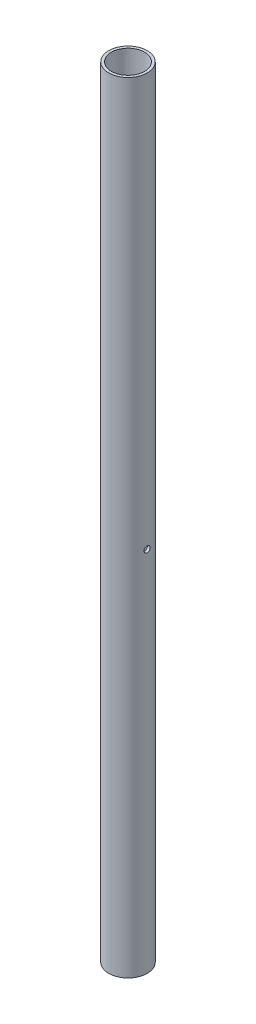
ISO-10303-21;
HEADER;
FILE_DESCRIPTION(('STEP AP214'),'2;1');
FILE_NAME('part.step','',(''),(''),'','','');
FILE_SCHEMA(('AUTOMOTIVE_DESIGN { 1 0 10303 214 1 1 1 1 }'));
ENDSEC;
DATA;
#1=APPLICATION_CONTEXT('core data for automotive mechanical design processes');
#2=APPLICATION_PROTOCOL_DEFINITION('international standard','automotive_design',2000,#1);
#3=PRODUCT_CONTEXT('',#1,'mechanical');
#4=PRODUCT('Part','Part','',(#3));
#5=PRODUCT_RELATED_PRODUCT_CATEGORY('part','',(#4));
#6=PRODUCT_DEFINITION_FORMATION('','',#4);
#7=PRODUCT_DEFINITION_CONTEXT('part definition',#1,'design');
#8=PRODUCT_DEFINITION('design','',#6,#7);
#9=PRODUCT_DEFINITION_SHAPE('','',#8);
#10=(LENGTH_UNIT() NAMED_UNIT(*) SI_UNIT(.MILLI.,.METRE.));
#11=(NAMED_UNIT(*) PLANE_ANGLE_UNIT() SI_UNIT($,.RADIAN.));
#12=(NAMED_UNIT(*) SI_UNIT($,.STERADIAN.) SOLID_ANGLE_UNIT());
#13=UNCERTAINTY_MEASURE_WITH_UNIT(LENGTH_MEASURE(1.E-05),#10,'distance_accuracy_value','');
#14=(GEOMETRIC_REPRESENTATION_CONTEXT(3) GLOBAL_UNCERTAINTY_ASSIGNED_CONTEXT((#13)) GLOBAL_UNIT_ASSIGNED_CONTEXT((#10,
#11,#12)) REPRESENTATION_CONTEXT('',''));
#15=CARTESIAN_POINT('',(0.,0.,0.));
#16=DIRECTION('',(0.,0.,1.));
#17=DIRECTION('',(1.,0.,0.));
#18=AXIS2_PLACEMENT_3D('',#15,#16,#17);
#19=CARTESIAN_POINT('',(0.,0.,0.));
#20=DIRECTION('',(0.,1.,0.));
#21=DIRECTION('',(0.,0.,1.));
#22=AXIS2_PLACEMENT_3D('',#19,#20,#21);
#23=CYLINDRICAL_SURFACE('',#22,25.9969);
#24=CARTESIAN_POINT('',(-25.5569443275208,574.167,-4.7625));
#25=CARTESIAN_POINT('',(-25.5569435022314,574.034426906002,-4.7625016519942));
#26=CARTESIAN_POINT('',(-25.5579780058452,573.901877137919,-4.75696223854384));
#27=CARTESIAN_POINT('',(-25.5620839582937,573.637691134125,-4.73485019257146));
#28=CARTESIAN_POINT('',(-25.5651558625793,573.506055109327,-4.71827509307285));
#29=CARTESIAN_POINT('',(-25.5732507134713,573.244589682944,-4.6742012203701));
#30=CARTESIAN_POINT('',(-25.5782750896231,573.114761677452,-4.64669444296097));
#31=CARTESIAN_POINT('',(-25.5901293091623,572.857883779135,-4.58096125738));
#32=CARTESIAN_POINT('',(-25.5969598199364,572.730834932066,-4.54273088640442));
#33=CARTESIAN_POINT('',(-25.6122182453585,572.480617273474,-4.45589791590844));
#34=CARTESIAN_POINT('',(-25.6206439910637,572.357443455452,-4.40730938856463));
#35=CARTESIAN_POINT('',(-25.6388562536836,572.115630240645,-4.30009396111335));
#36=CARTESIAN_POINT('',(-25.6486432791552,571.99699255972,-4.24146330749237));
#37=CARTESIAN_POINT('',(-25.6796278990718,571.649265264878,-4.05118392120631));
#38=CARTESIAN_POINT('',(-25.7024688505728,571.428053388312,-3.90504041367218));
#39=CARTESIAN_POINT('',(-25.7502464376007,571.010838011115,-3.57649200963156));
#40=CARTESIAN_POINT('',(-25.7752026783148,570.815125783708,-3.39372004066405));
#41=CARTESIAN_POINT('',(-25.8119525931666,570.546587700914,-3.09707856477701));
#42=CARTESIAN_POINT('',(-25.8240964249994,570.461197739246,-2.99437418317596));
#43=CARTESIAN_POINT('',(-25.8478225338879,570.299322515098,-2.78213250866639));
#44=CARTESIAN_POINT('',(-25.8594050197638,570.222833926246,-2.6725977918532));
#45=CARTESIAN_POINT('',(-25.8817765032373,570.078716113158,-2.44652067815375));
#46=CARTESIAN_POINT('',(-25.8925583288723,570.011163511535,-2.32992878685024));
#47=CARTESIAN_POINT('',(-25.912915133473,569.886162545654,-2.09140107944697));
#48=CARTESIAN_POINT('',(-25.9224905605596,569.828710426382,-1.96946727043824));
#49=CARTESIAN_POINT('',(-25.9401588219765,569.724356398202,-1.72117462286801));
#50=CARTESIAN_POINT('',(-25.9482528513248,569.677445978463,-1.59481944984244));
#51=CARTESIAN_POINT('',(-25.9627347127051,569.594489332138,-1.33854185813782));
#52=CARTESIAN_POINT('',(-25.9691229604252,569.558440458387,-1.20862031708668));
#53=CARTESIAN_POINT('',(-25.9818790112736,569.487012086128,-0.901033281887136));
#54=CARTESIAN_POINT('',(-25.9874880450333,569.456104369801,-0.722278498790977));
#55=CARTESIAN_POINT('',(-25.9949979755023,569.414849638883,-0.362334596423418));
#56=CARTESIAN_POINT('',(-25.9968989372398,569.404502263726,-0.181145519898159));
#57=CARTESIAN_POINT('',(-25.9969007779147,569.404498343007,0.132594129715133));
#58=CARTESIAN_POINT('',(-25.9958836117793,569.410039477896,0.265164922289751));
#59=CARTESIAN_POINT('',(-25.9918448928766,569.432158710194,0.52939367289199));
#60=CARTESIAN_POINT('',(-25.9888228924146,569.448739272793,0.661051420392835));
#61=CARTESIAN_POINT('',(-25.9808549279305,569.492827640559,0.92256018806719));
#62=CARTESIAN_POINT('',(-25.9759075612562,569.520343412467,1.05240981940978));
#63=CARTESIAN_POINT('',(-25.9642253634347,569.586100313305,1.30933322500081));
#64=CARTESIAN_POINT('',(-25.9574898727271,569.624345400104,1.43640595621574));
#65=CARTESIAN_POINT('',(-25.9424297829589,569.711207687545,1.68666596023607));
#66=CARTESIAN_POINT('',(-25.9341073184392,569.759810966234,1.80985819603276));
#67=CARTESIAN_POINT('',(-25.916093926232,569.867079543716,2.05173076847075));
#68=CARTESIAN_POINT('',(-25.9064024942186,569.925748552429,2.17040942177106));
#69=CARTESIAN_POINT('',(-25.8859250278616,570.052679850368,2.4023412043127));
#70=CARTESIAN_POINT('',(-25.8751395539806,570.120937234432,2.51559706823607));
#71=CARTESIAN_POINT('',(-25.8527606026393,570.266614428611,2.73602971122386));
#72=CARTESIAN_POINT('',(-25.8411668248522,570.344037651852,2.84320420362534));
#73=CARTESIAN_POINT('',(-25.8173738130133,570.508304243676,3.05174437268176));
#74=CARTESIAN_POINT('',(-25.8051697173725,570.595233364841,3.15304195602531));
#75=CARTESIAN_POINT('',(-25.780598999428,570.777306970566,3.34801213856994));
#76=CARTESIAN_POINT('',(-25.7682323185993,570.872454486148,3.44168189960051));
#77=CARTESIAN_POINT('',(-25.7436899636838,571.070260531103,3.62069031311283));
#78=CARTESIAN_POINT('',(-25.7315142352722,571.17291687539,3.70603137252294));
#79=CARTESIAN_POINT('',(-25.7076877679954,571.385107943582,3.86785374086368));
#80=CARTESIAN_POINT('',(-25.6960372244145,571.494645190422,3.9443317705104));
#81=CARTESIAN_POINT('',(-25.6735156111352,571.720629805377,4.08836891049098));
#82=CARTESIAN_POINT('',(-25.6626507376893,571.83712113571,4.15586005076397));
#83=CARTESIAN_POINT('',(-25.6421052945682,572.075524084205,4.28080083570022));
#84=CARTESIAN_POINT('',(-25.6324251688821,572.197437711201,4.33824671929931));
#85=CARTESIAN_POINT('',(-25.6145431566518,572.44574272747,4.44261177958259));
#86=CARTESIAN_POINT('',(-25.606340622071,572.572132124529,4.48953557322954));
#87=CARTESIAN_POINT('',(-25.5916480394946,572.82853707486,4.57253899249754));
#88=CARTESIAN_POINT('',(-25.5851586235047,572.958553946879,4.60861461668063));
#89=CARTESIAN_POINT('',(-25.5687024999131,573.349615748578,4.69938414902781));
#90=CARTESIAN_POINT('',(-25.5615208483999,573.614730099288,4.73790033784556));
#91=CARTESIAN_POINT('',(-25.5555629285528,574.14774525015,4.76993772216578));
#92=CARTESIAN_POINT('',(-25.5567859538712,574.415645814252,4.76346269882962));
#93=CARTESIAN_POINT('',(-25.5647387239316,574.811826221684,4.72049188836733));
#94=CARTESIAN_POINT('',(-25.568370638211,574.942195247262,4.70083518426897));
#95=CARTESIAN_POINT('',(-25.5775186860862,575.200777215956,4.65080871656991));
#96=CARTESIAN_POINT('',(-25.5830341147503,575.328990946913,4.62044296084381));
#97=CARTESIAN_POINT('',(-25.5957962924784,575.582424100489,4.54921115931196));
#98=CARTESIAN_POINT('',(-25.6030437284578,575.707642313352,4.50834094694428));
#99=CARTESIAN_POINT('',(-25.6190583120678,575.954138330245,4.41642801319908));
#100=CARTESIAN_POINT('',(-25.6278249270543,576.075417497718,4.36538885624997));
#101=CARTESIAN_POINT('',(-25.6466903301581,576.313986550088,4.25315647739893));
#102=CARTESIAN_POINT('',(-25.6567969483597,576.431247453408,4.19190298121288));
#103=CARTESIAN_POINT('',(-25.6780114393711,576.660161375324,4.05992628497872));
#104=CARTESIAN_POINT('',(-25.6891189589237,576.771816350974,3.9892064217367));
#105=CARTESIAN_POINT('',(-25.7120327805372,576.988857273146,3.83874595290599));
#106=CARTESIAN_POINT('',(-25.7238393357904,577.094240920125,3.75900206914764));
#107=CARTESIAN_POINT('',(-25.7478169181814,577.297958819531,3.59108914908507));
#108=CARTESIAN_POINT('',(-25.7599878155341,577.396295540814,3.50292308895362));
#109=CARTESIAN_POINT('',(-25.7845502224845,577.586748767761,3.3173290184684));
#110=CARTESIAN_POINT('',(-25.7969422681437,577.678747681698,3.21978036448215));
#111=CARTESIAN_POINT('',(-25.8214090593172,577.854181427793,3.01728983543673));
#112=CARTESIAN_POINT('',(-25.8334839178131,577.937619341008,2.91235064328351));
#113=CARTESIAN_POINT('',(-25.8569918465873,578.095450168811,2.69567518535068));
#114=CARTESIAN_POINT('',(-25.8684243803524,578.169835580866,2.58393339522678));
#115=CARTESIAN_POINT('',(-25.8903109800241,578.308921792068,2.35454332728406));
#116=CARTESIAN_POINT('',(-25.9007654165309,578.373626264928,2.23689731274309));
#117=CARTESIAN_POINT('',(-25.9204288529103,578.493049874451,1.99619411066832));
#118=CARTESIAN_POINT('',(-25.9296348712611,578.547745212,1.87312486779611));
#119=CARTESIAN_POINT('',(-25.9465068680863,578.646529519597,1.62275223016558));
#120=CARTESIAN_POINT('',(-25.9541734443674,578.6906226081,1.49545050146611));
#121=CARTESIAN_POINT('',(-25.9677402551085,578.767823056664,1.23770085854887));
#122=CARTESIAN_POINT('',(-25.9736434204478,578.800948655299,1.10725855855992));
#123=CARTESIAN_POINT('',(-25.9835288197735,578.856040873629,0.84402082991778));
#124=CARTESIAN_POINT('',(-25.9875119724719,578.878012830528,0.711226558264559));
#125=CARTESIAN_POINT('',(-25.9926094437131,578.906036629652,0.481932158935393));
#126=CARTESIAN_POINT('',(-25.9942162039644,578.914831704812,0.385769029871881));
#127=CARTESIAN_POINT('',(-25.9963615918164,578.926563632449,0.193073695770981));
#128=CARTESIAN_POINT('',(-25.9969002174737,578.929500474268,0.0965414900623911));
#129=CARTESIAN_POINT('',(-25.9968997015466,578.929499349131,-0.132490244502533));
#130=CARTESIAN_POINT('',(-25.9958845523856,578.923966592277,-0.264997975045957));
#131=CARTESIAN_POINT('',(-25.9918508160171,578.901872812832,-0.529111409795861));
#132=CARTESIAN_POINT('',(-25.9888313098389,578.885306731598,-0.660716672256589));
#133=CARTESIAN_POINT('',(-25.9808664435839,578.841236646839,-0.922240661736631));
#134=CARTESIAN_POINT('',(-25.9759180424928,578.813715370356,-1.05215638923257));
#135=CARTESIAN_POINT('',(-25.9642321085038,578.747937866881,-1.30920777970607));
#136=CARTESIAN_POINT('',(-25.9574938953294,578.709677557855,-1.4363423656917));
#137=CARTESIAN_POINT('',(-25.942428525964,578.622785305314,-1.68668359900874));
#138=CARTESIAN_POINT('',(-25.9341040933392,578.574171122978,-1.80989656268336));
#139=CARTESIAN_POINT('',(-25.9160902737655,578.466897411178,-2.05178474988724));
#140=CARTESIAN_POINT('',(-25.906400376179,578.408234121911,-2.17045825460587));
#141=CARTESIAN_POINT('',(-25.875688555506,578.217876895846,-2.51823186731758));
#142=CARTESIAN_POINT('',(-25.8530012915155,578.071687878227,-2.73945144921011));
#143=CARTESIAN_POINT('',(-25.8054133921278,577.743100429004,-3.15660135792174));
#144=CARTESIAN_POINT('',(-25.7804924067525,577.560345326281,-3.35224843428099));
#145=CARTESIAN_POINT('',(-25.7436897632039,577.263744779495,-3.62069685102844));
#146=CARTESIAN_POINT('',(-25.731510396537,577.161053811005,-3.70606007143075));
#147=CARTESIAN_POINT('',(-25.7076829813141,576.948844555032,-3.86788362283609));
#148=CARTESIAN_POINT('',(-25.6960347355331,576.83932883818,-3.94434727522916));
#149=CARTESIAN_POINT('',(-25.6735051384142,576.613266116038,-4.08843630523622));
#150=CARTESIAN_POINT('',(-25.6626309893115,576.496668108165,-4.15598269383298));
#151=CARTESIAN_POINT('',(-25.6420769628728,576.258128722832,-4.28097057040745));
#152=CARTESIAN_POINT('',(-25.6323966420233,576.13618935267,-4.3384158144102));
#153=CARTESIAN_POINT('',(-25.6145181190155,575.887886406129,-4.44275528686966));
#154=CARTESIAN_POINT('',(-25.6063187061094,575.761526545647,-4.4896581422227));
#155=CARTESIAN_POINT('',(-25.591637538392,575.505238390036,-4.57259956929987));
#156=CARTESIAN_POINT('',(-25.5851553639381,575.375310975294,-4.608640795584));
#157=CARTESIAN_POINT('',(-25.5722081693249,575.067770011744,-4.6800363889096));
#158=CARTESIAN_POINT('',(-25.5665097494964,574.889068276252,-4.7109257930994));
#159=CARTESIAN_POINT('',(-25.5588784241815,574.529229824846,-4.75215629615811));
#160=CARTESIAN_POINT('',(-25.5569454548556,574.348093150265,-4.76249774339706));
#161=CARTESIAN_POINT('',(-25.5569443275208,574.167,-4.7625));
#162=B_SPLINE_CURVE_WITH_KNOTS('',3,(#24,#25,#26,#27,#28,#29,#30,#31,#32,#33,#34,#35,#36,#37,
#38,#39,#40,#41,#42,#43,#44,#45,#46,#47,#48,#49,#50,#51,#52,#53,#54,#55,#56,#57,#58,#59,#60,#61,
#62,#63,#64,#65,#66,#67,#68,#69,#70,#71,#72,#73,#74,#75,#76,#77,#78,#79,#80,#81,#82,#83,#84,#85,
#86,#87,#88,#89,#90,#91,#92,#93,#94,#95,#96,#97,#98,#99,#100,#101,#102,#103,#104,#105,#106,#107,
#108,#109,#110,#111,#112,#113,#114,#115,#116,#117,#118,#119,#120,#121,#122,#123,#124,#125,#126,
#127,#128,#129,#130,#131,#132,#133,#134,#135,#136,#137,#138,#139,#140,#141,#142,#143,#144,#145,
#146,#147,#148,#149,#150,#151,#152,#153,#154,#155,#156,#157,#158,#159,#160,#161),.UNSPECIFIED.,
.T.,.F.,(4,2,2,2,2,2,2,2,2,2,2,2,2,2,2,2,2,2,2,2,2,2,2,2,2,2,2,2,2,2,2,2,2,2,2,2,2,2,2,2,2,2,2,
2,2,2,2,2,2,2,2,2,2,2,2,2,2,2,2,2,2,2,2,2,2,2,2,2,4),(0.,0.397559491860131,0.795207886158778,
1.19314797774036,1.59123531853851,1.98878524168473,2.38648408533378,3.18091369423469,
3.98374323690006,4.38569890959545,4.78750388900652,5.19255725483606,5.59745971582146,
6.00203409533944,6.40650979245759,6.94973773253128,7.49295614596972,7.89057885734344,
8.288290390781,8.68629220579983,9.08444103064649,9.48205805998317,9.87982195480523,
10.2773831000386,10.6750927553409,11.0767438408688,11.4785436968498,11.8802270898795,
12.2820586327661,12.6867749087063,13.0916423923101,13.4963318759281,13.9011704500548,
14.7010094571147,15.5007812447417,15.8960710654405,16.291213105197,16.6865121194148,
17.0816728160366,17.4792536812533,17.8766947701661,18.2742807044188,18.6717266584915,
19.0752277998374,19.4785832102065,19.8822706692143,20.2858045466177,20.6902857968962,
21.0946096711968,21.4982577509839,21.9017124959596,22.1912717259509,22.4808314827852,
22.878213405897,23.2757776492059,23.6739712271832,24.072316368737,24.4699836094207,
24.867799960828,25.6622811889718,26.4649269890628,26.8668108120833,27.2685441646131,
27.6736263577839,28.0785576045748,28.4831562776143,28.8876559872221,29.430726374032,
29.9737875535486),.UNSPECIFIED.);
#163=CARTESIAN_POINT('',(-25.5569443275208,574.167,-4.7625));
#164=VERTEX_POINT('',#163);
#165=EDGE_CURVE('E56',#164,#164,#162,.T.);
#166=ORIENTED_EDGE('',*,*,#165,.T.);
#167=EDGE_LOOP('',(#166));
#168=FACE_BOUND('',#167,.T.);
#169=CARTESIAN_POINT('',(0.,1219.2,0.));
#170=DIRECTION('',(0.,1.,0.));
#171=DIRECTION('',(0.,0.,1.));
#172=AXIS2_PLACEMENT_3D('',#169,#170,#171);
#173=CIRCLE('',#172,25.9969);
#174=CARTESIAN_POINT('',(0.,1219.2,25.9969));
#175=VERTEX_POINT('',#174);
#176=EDGE_CURVE('E18',#175,#175,#173,.F.);
#177=ORIENTED_EDGE('',*,*,#176,.F.);
#178=EDGE_LOOP('',(#177));
#179=FACE_BOUND('',#178,.T.);
#180=CARTESIAN_POINT('',(25.5569443275208,574.167,-4.7625));
#181=CARTESIAN_POINT('',(25.5569400050294,574.299722881701,-4.76250944609182));
#182=CARTESIAN_POINT('',(25.5579789317999,574.432369664628,-4.75695436722959));
#183=CARTESIAN_POINT('',(25.5620928252764,574.696692008777,-4.73480532028573));
#184=CARTESIAN_POINT('',(25.5651669614467,574.828367944032,-4.71821585514327));
#185=CARTESIAN_POINT('',(25.5732659951668,575.089839029998,-4.67411683009229));
#186=CARTESIAN_POINT('',(25.5782913681409,575.219633714338,-4.64660460878685));
#187=CARTESIAN_POINT('',(25.590142358483,575.476356251478,-4.58088846387274));
#188=CARTESIAN_POINT('',(25.5969673398919,575.603285099862,-4.542688316953));
#189=CARTESIAN_POINT('',(25.6122198531612,575.853412377049,-4.45588854095513));
#190=CARTESIAN_POINT('',(25.6206471372051,575.976611379309,-4.40729051989535));
#191=CARTESIAN_POINT('',(25.6388601847205,576.218408880346,-4.30007116759752));
#192=CARTESIAN_POINT('',(25.6486454592688,576.337009015299,-4.24145344204544));
#193=CARTESIAN_POINT('',(25.6693043235323,576.568900472502,-4.11457842952453));
#194=CARTESIAN_POINT('',(25.6801783672589,576.682189550913,-4.04631711630983));
#195=CARTESIAN_POINT('',(25.7027029040888,576.902607941264,-3.90067921551514));
#196=CARTESIAN_POINT('',(25.7143531232488,577.009739401865,-3.82330583662215));
#197=CARTESIAN_POINT('',(25.7382397248821,577.218299845623,-3.65906867906038));
#198=CARTESIAN_POINT('',(25.7504810939035,577.319654389194,-3.57211108104002));
#199=CARTESIAN_POINT('',(25.7750828766001,577.514663221261,-3.39003628635352));
#200=CARTESIAN_POINT('',(25.7874432460709,577.608320254507,-3.29492202309853));
#201=CARTESIAN_POINT('',(25.8119499746003,577.787391103725,-3.09709312859018));
#202=CARTESIAN_POINT('',(25.8240961975213,577.872799820309,-2.9943738641103));
#203=CARTESIAN_POINT('',(25.8478238246475,578.034687179479,-2.78212331552921));
#204=CARTESIAN_POINT('',(25.8594054360238,578.111169112124,-2.67259456409175));
#205=CARTESIAN_POINT('',(25.8817762383539,578.255281820754,-2.44652236823886));
#206=CARTESIAN_POINT('',(25.8925582524248,578.322835900781,-2.32992929950486));
#207=CARTESIAN_POINT('',(25.9129151944687,578.447837947105,-2.0914007477026));
#208=CARTESIAN_POINT('',(25.9224905703451,578.505289666543,-1.96946726977431));
#209=CARTESIAN_POINT('',(25.9401587963382,578.609643414979,-1.72117484711262));
#210=CARTESIAN_POINT('',(25.9482528411168,578.656553952233,-1.59481956731776));
#211=CARTESIAN_POINT('',(25.9627347156263,578.739510695422,-1.33854186960171));
#212=CARTESIAN_POINT('',(25.9691229610483,578.775559548548,-1.2086203292788));
#213=CARTESIAN_POINT('',(25.9818790034042,578.846987865179,-0.901033435087688));
#214=CARTESIAN_POINT('',(25.9874880355915,578.877895576813,-0.722278786589189));
#215=CARTESIAN_POINT('',(25.9949979729985,578.919150348883,-0.36233488114473));
#216=CARTESIAN_POINT('',(25.9968989373577,578.929497737235,-0.181145663073871));
#217=CARTESIAN_POINT('',(25.9969007778282,578.929501656289,0.132594194819177));
#218=CARTESIAN_POINT('',(25.995883610748,578.92396051643,0.265165053385207));
#219=CARTESIAN_POINT('',(25.9918448879131,578.901841262646,0.529393934034541));
#220=CARTESIAN_POINT('',(25.9888228844647,578.885260683535,0.661051745591296));
#221=CARTESIAN_POINT('',(25.9808549161779,578.841172294093,0.92256050945827));
#222=CARTESIAN_POINT('',(25.975907550586,578.813656527803,1.05241007481652));
#223=CARTESIAN_POINT('',(25.9642253567775,578.747899648893,1.3093333506622));
#224=CARTESIAN_POINT('',(25.9574898690027,578.709654578416,1.43640601811892));
#225=CARTESIAN_POINT('',(25.9424297850859,578.622792324722,1.68666592487824));
#226=CARTESIAN_POINT('',(25.9341073231452,578.574189061243,1.80985812638239));
#227=CARTESIAN_POINT('',(25.9160939367996,578.466920519761,2.05173063303902));
#228=CARTESIAN_POINT('',(25.9064025080688,578.408251531839,2.17040925485054));
#229=CARTESIAN_POINT('',(25.8859250429549,578.281320244772,2.40234104340855));
#230=CARTESIAN_POINT('',(25.8751395664138,578.21306284536,2.51559694180918));
#231=CARTESIAN_POINT('',(25.8527606091978,578.067385615225,2.73602965058366));
#232=CARTESIAN_POINT('',(25.8411668281952,577.989962371369,2.84320417428947));
#233=CARTESIAN_POINT('',(25.8173738087882,577.825695727012,3.05174440974924));
#234=CARTESIAN_POINT('',(25.8051697087566,577.738766573254,3.15304202765743));
#235=CARTESIAN_POINT('',(25.78059898195,577.556692897979,3.34801227399246));
#236=CARTESIAN_POINT('',(25.7682322966498,577.461545345437,3.44168206424526));
#237=CARTESIAN_POINT('',(25.7436899421277,577.26373928668,3.62069046578341));
#238=CARTESIAN_POINT('',(25.7315142184488,577.161082970856,3.70603148984171));
#239=CARTESIAN_POINT('',(25.7076877593156,576.948891983051,3.8678537967533));
#240=CARTESIAN_POINT('',(25.6960372191407,576.839354788196,3.94433180039743));
#241=CARTESIAN_POINT('',(25.6735156191997,576.613370243781,4.08836886278333));
#242=CARTESIAN_POINT('',(25.6626507555005,576.496878933068,4.15585995373946));
#243=CARTESIAN_POINT('',(25.6421053162978,576.25847630589,4.28080069226559));
#244=CARTESIAN_POINT('',(25.6324251844928,576.136562981969,4.33824658120156));
#245=CARTESIAN_POINT('',(25.6145431823444,575.888257152883,4.44261167668073));
#246=CARTESIAN_POINT('',(25.6063406698864,575.761866622045,4.48953545789393));
#247=CARTESIAN_POINT('',(25.5916479506346,575.505463462837,4.57253933968926));
#248=CARTESIAN_POINT('',(25.5851583672672,575.375449534699,4.60861549290242));
#249=CARTESIAN_POINT('',(25.5687029776682,574.98437669572,4.69938257504319));
#250=CARTESIAN_POINT('',(25.5615234769806,574.719229679598,4.73789159116452));
#251=CARTESIAN_POINT('',(25.5555602899944,574.186294055022,4.76994652294654));
#252=CARTESIAN_POINT('',(25.5567758838276,573.918505675028,4.76349629380147));
#253=CARTESIAN_POINT('',(25.5673735884426,573.391259413073,4.70627560963214));
#254=CARTESIAN_POINT('',(25.5766530348105,573.131739164008,4.65606229802386));
#255=CARTESIAN_POINT('',(25.6021756426717,572.624880141849,4.51360147768391));
#256=CARTESIAN_POINT('',(25.6184190888665,572.377541867239,4.42135225043458));
#257=CARTESIAN_POINT('',(25.6561465739384,571.900416579872,4.19689317444994));
#258=CARTESIAN_POINT('',(25.6776601672459,571.6707384953,4.06445692485988));
#259=CARTESIAN_POINT('',(25.7234844355029,571.23665547438,3.76354230832722));
#260=CARTESIAN_POINT('',(25.7477953814203,571.032252990358,3.59506044843656));
#261=CARTESIAN_POINT('',(25.7969233867279,570.651301193066,3.22382589193994));
#262=CARTESIAN_POINT('',(25.8217425613282,570.475216659028,3.02059618945732));
#263=CARTESIAN_POINT('',(25.8687543635956,570.159571765488,2.58723459578893));
#264=CARTESIAN_POINT('',(25.8909469666298,570.020011748511,2.35710245234293));
#265=CARTESIAN_POINT('',(25.9302468801214,569.781314671442,1.87599412689295));
#266=CARTESIAN_POINT('',(25.9473483006806,569.682224381173,1.62499422930812));
#267=CARTESIAN_POINT('',(25.9744931326477,569.527741184126,1.10952961185133));
#268=CARTESIAN_POINT('',(25.9845372621256,569.472343831578,0.845066264805239));
#269=CARTESIAN_POINT('',(25.9963380301829,569.4074622489,0.314182046366993));
#270=CARTESIAN_POINT('',(25.9982096557421,569.397340935688,0.0478415072906781));
#271=CARTESIAN_POINT('',(25.9937715828156,569.421592082386,-0.482726928990831));
#272=CARTESIAN_POINT('',(25.9874622645842,569.455962474298,-0.746954923813801));
#273=CARTESIAN_POINT('',(25.9674427448165,569.567691567902,-1.26378793697742));
#274=CARTESIAN_POINT('',(25.9537878180693,569.644729329347,-1.51646466358317));
#275=CARTESIAN_POINT('',(25.9206017565245,569.839260485411,-2.0053168064679));
#276=CARTESIAN_POINT('',(25.9010702185155,569.956756656078,-2.2414910890956));
#277=CARTESIAN_POINT('',(25.8580104866525,570.230291601724,-2.69336553963903));
#278=CARTESIAN_POINT('',(25.8344424941037,570.386721990946,-2.90882478218347));
#279=CARTESIAN_POINT('',(25.7860310162425,570.733147988466,-3.31065695244592));
#280=CARTESIAN_POINT('',(25.7611874521106,570.92314567271,-3.49702807988523));
#281=CARTESIAN_POINT('',(25.7126461863034,571.334182512025,-3.83779949536924));
#282=CARTESIAN_POINT('',(25.6889668327429,571.555582122874,-3.99176806452735));
#283=CARTESIAN_POINT('',(25.6457952900939,572.021508300814,-4.26034901420478));
#284=CARTESIAN_POINT('',(25.6263035729691,572.266037470233,-4.37495695949052));
#285=CARTESIAN_POINT('',(25.5931267548813,572.781546752401,-4.5651334343563));
#286=CARTESIAN_POINT('',(25.5797081925327,573.053196497315,-4.63893681189436));
#287=CARTESIAN_POINT('',(25.5616220435886,573.605678152492,-4.73760733255504));
#288=CARTESIAN_POINT('',(25.5569534624934,573.886509015563,-4.76248003702482));
#289=CARTESIAN_POINT('',(25.5569443275208,574.167,-4.7625));
#290=B_SPLINE_CURVE_WITH_KNOTS('',3,(#180,#181,#182,#183,#184,#185,#186,#187,#188,#189,#190,
#191,#192,#193,#194,#195,#196,#197,#198,#199,#200,#201,#202,#203,#204,#205,#206,#207,#208,#209,
#210,#211,#212,#213,#214,#215,#216,#217,#218,#219,#220,#221,#222,#223,#224,#225,#226,#227,#228,
#229,#230,#231,#232,#233,#234,#235,#236,#237,#238,#239,#240,#241,#242,#243,#244,#245,#246,#247,
#248,#249,#250,#251,#252,#253,#254,#255,#256,#257,#258,#259,#260,#261,#262,#263,#264,#265,#266,
#267,#268,#269,#270,#271,#272,#273,#274,#275,#276,#277,#278,#279,#280,#281,#282,#283,#284,#285,
#286,#287,#288,#289),.UNSPECIFIED.,.T.,.F.,(4,2,2,2,2,2,2,2,2,2,2,2,2,2,2,2,2,2,2,2,2,2,2,2,2,2,
2,2,2,2,2,2,2,2,2,2,2,2,2,2,2,2,2,2,2,2,2,2,2,2,2,2,2,2,4),(0.,0.397917155871949,
0.795672028288525,1.19352387567078,1.5912353151604,1.98888529346787,2.38639247375316,
2.78406610843908,3.1816001242729,3.58344520113136,3.98514636222259,4.38709429978157,
4.78889362431262,5.19394687065073,5.59884931577996,6.00342376278961,6.40789952776266,
6.95112703649206,7.49434588127247,7.89196878933453,8.2896805192334,8.68768213784979,
9.08583076594766,9.48344768294316,9.8812114654679,10.2787727228745,10.676482490644,
11.0781337182756,11.4799337164946,11.8816169689848,12.2834483680698,12.6881644005894,
13.0930315440076,13.4977223216039,13.9025601853586,14.7023998748671,15.5021709800518,
16.2919066002325,17.0816745093825,17.8759770318925,18.6703565600383,19.4766749435271,
20.2830008883518,21.0902560643222,21.8974290912343,22.6932078452379,23.4889496123673,
24.2787856094495,25.0686758118408,25.8668570336138,26.6650876356688,27.4733606602906,
28.2817247328689,29.122761795216,29.9637032617112),.UNSPECIFIED.);
#291=CARTESIAN_POINT('',(25.5569443275208,574.167,-4.7625));
#292=VERTEX_POINT('',#291);
#293=EDGE_CURVE('E60',#292,#292,#290,.T.);
#294=ORIENTED_EDGE('',*,*,#293,.T.);
#295=EDGE_LOOP('',(#294));
#296=FACE_BOUND('',#295,.T.);
#297=CARTESIAN_POINT('',(0.,0.,0.));
#298=DIRECTION('',(0.,1.,0.));
#299=DIRECTION('',(0.,0.,1.));
#300=AXIS2_PLACEMENT_3D('',#297,#298,#299);
#301=CIRCLE('',#300,25.9969);
#302=CARTESIAN_POINT('',(0.,0.,25.9969));
#303=VERTEX_POINT('',#302);
#304=EDGE_CURVE('E61',#303,#303,#301,.F.);
#305=ORIENTED_EDGE('',*,*,#304,.T.);
#306=EDGE_LOOP('',(#305));
#307=FACE_BOUND('',#306,.T.);
#308=ADVANCED_FACE('F14',(#168,#179,#296,#307),#23,.F.);
#309=CARTESIAN_POINT('',(0.,1219.2,0.));
#310=DIRECTION('',(0.,1.,0.));
#311=DIRECTION('',(0.,0.,1.));
#312=AXIS2_PLACEMENT_3D('',#309,#310,#311);
#313=PLANE('',#312);
#314=ORIENTED_EDGE('',*,*,#176,.T.);
#315=EDGE_LOOP('',(#314));
#316=FACE_BOUND('',#315,.T.);
#317=CARTESIAN_POINT('',(0.,1219.2,0.));
#318=DIRECTION('',(0.,1.,0.));
#319=DIRECTION('',(0.,0.,1.));
#320=AXIS2_PLACEMENT_3D('',#317,#318,#319);
#321=CIRCLE('',#320,30.1625);
#322=CARTESIAN_POINT('',(0.,1219.2,30.1625));
#323=VERTEX_POINT('',#322);
#324=EDGE_CURVE('E46',#323,#323,#321,.F.);
#325=ORIENTED_EDGE('',*,*,#324,.F.);
#326=EDGE_LOOP('',(#325));
#327=FACE_BOUND('',#326,.T.);
#328=ADVANCED_FACE('F70',(#316,#327),#313,.T.);
#329=CARTESIAN_POINT('',(0.,0.,0.));
#330=DIRECTION('',(0.,1.,0.));
#331=DIRECTION('',(0.,0.,1.));
#332=AXIS2_PLACEMENT_3D('',#329,#330,#331);
#333=PLANE('',#332);
#334=ORIENTED_EDGE('',*,*,#304,.F.);
#335=EDGE_LOOP('',(#334));
#336=FACE_BOUND('',#335,.T.);
#337=CARTESIAN_POINT('',(0.,0.,0.));
#338=DIRECTION('',(0.,1.,0.));
#339=DIRECTION('',(0.,0.,1.));
#340=AXIS2_PLACEMENT_3D('',#337,#338,#339);
#341=CIRCLE('',#340,30.1625);
#342=CARTESIAN_POINT('',(0.,0.,30.1625));
#343=VERTEX_POINT('',#342);
#344=EDGE_CURVE('E22',#343,#343,#341,.T.);
#345=ORIENTED_EDGE('',*,*,#344,.F.);
#346=EDGE_LOOP('',(#345));
#347=FACE_BOUND('',#346,.T.);
#348=ADVANCED_FACE('F52',(#336,#347),#333,.F.);
#349=CARTESIAN_POINT('',(0.,574.167,0.));
#350=DIRECTION('',(1.,0.,0.));
#351=DIRECTION('',(0.,0.,-1.));
#352=AXIS2_PLACEMENT_3D('',#349,#350,#351);
#353=CYLINDRICAL_SURFACE('',#352,4.7625);
#354=ORIENTED_EDGE('',*,*,#165,.F.);
#355=EDGE_LOOP('',(#354));
#356=FACE_BOUND('',#355,.T.);
#357=CARTESIAN_POINT('',(-30.1625,578.9295,0.));
#358=CARTESIAN_POINT('',(-30.1625006411432,578.929501551686,0.132905058159211));
#359=CARTESIAN_POINT('',(-30.1616198458398,578.923934530737,0.265787704919034));
#360=CARTESIAN_POINT('',(-30.1581225730138,578.901710504743,0.530641525030536));
#361=CARTESIAN_POINT('',(-30.1555057001137,578.885050973466,0.662612483833445));
#362=CARTESIAN_POINT('',(-30.1486061024345,578.840748655528,0.924751602550834));
#363=CARTESIAN_POINT('',(-30.1443221318156,578.813097654492,1.05491833863286));
#364=CARTESIAN_POINT('',(-30.1342070196324,578.747010770052,1.31247439186831));
#365=CARTESIAN_POINT('',(-30.1283753089955,578.708570919507,1.43986266875694));
#366=CARTESIAN_POINT('',(-30.1153364640811,578.621250788617,1.69076295880994));
#367=CARTESIAN_POINT('',(-30.1081309937853,578.572383130619,1.81427945309342));
#368=CARTESIAN_POINT('',(-30.0925375614775,578.46451836827,2.05678377334598));
#369=CARTESIAN_POINT('',(-30.0841491639036,578.405517531064,2.17576991061977));
#370=CARTESIAN_POINT('',(-30.0664290525388,578.277857282281,2.40828563344181));
#371=CARTESIAN_POINT('',(-30.0570978415468,578.209203011274,2.52181808025388));
#372=CARTESIAN_POINT('',(-30.0377423418686,578.062669289843,2.74276246654927));
#373=CARTESIAN_POINT('',(-30.0277177963313,577.984786412909,2.85017211062199));
#374=CARTESIAN_POINT('',(-30.0071797663288,577.819750762204,3.05886336594896));
#375=CARTESIAN_POINT('',(-29.9966632281242,577.732534024312,3.1600940977587));
#376=CARTESIAN_POINT('',(-29.9755007943492,577.549880006018,3.35490148671306));
#377=CARTESIAN_POINT('',(-29.964854852339,577.454439694797,3.44847529689407));
#378=CARTESIAN_POINT('',(-29.9437394166451,577.256053638631,3.6272548965556));
#379=CARTESIAN_POINT('',(-29.9332698705451,577.153110173474,3.71246320952676));
#380=CARTESIAN_POINT('',(-29.9127951237681,576.940359880475,3.87398060165941));
#381=CARTESIAN_POINT('',(-29.9027900957854,576.830550535144,3.95028638682204));
#382=CARTESIAN_POINT('',(-29.8834829281697,576.604277082506,4.09379112854416));
#383=CARTESIAN_POINT('',(-29.8741846614733,576.487781699914,4.16094131206899));
#384=CARTESIAN_POINT('',(-29.8566135112701,576.249427397428,4.28520423780306));
#385=CARTESIAN_POINT('',(-29.8483410110179,576.127566495734,4.34231323165941));
#386=CARTESIAN_POINT('',(-29.833070299324,575.879423555141,4.44601818545168));
#387=CARTESIAN_POINT('',(-29.8260715514367,575.753143404267,4.49261857311302));
#388=CARTESIAN_POINT('',(-29.813545878212,575.497012831419,4.57499731142518));
#389=CARTESIAN_POINT('',(-29.8080194984462,575.367161105641,4.61077165125518));
#390=CARTESIAN_POINT('',(-29.793995817805,574.975936377059,4.7008604195438));
#391=CARTESIAN_POINT('',(-29.7879045259246,574.710538280985,4.73892099965707));
#392=CARTESIAN_POINT('',(-29.7829480099517,574.177060543419,4.76997764016859));
#393=CARTESIAN_POINT('',(-29.7840823378132,573.908981069222,4.76297649475263));
#394=CARTESIAN_POINT('',(-29.7910453456361,573.51212839551,4.71912404652834));
#395=CARTESIAN_POINT('',(-29.7942194694664,573.381251744463,4.69909856736974));
#396=CARTESIAN_POINT('',(-29.8021965613446,573.121681966009,4.64824443820714));
#397=CARTESIAN_POINT('',(-29.806998920144,572.99298804076,4.6174198288491));
#398=CARTESIAN_POINT('',(-29.8180997908883,572.738629162606,4.54517962705812));
#399=CARTESIAN_POINT('',(-29.8243988911431,572.612965422194,4.50375986960027));
#400=CARTESIAN_POINT('',(-29.8383095760588,572.365623776678,4.41065785449488));
#401=CARTESIAN_POINT('',(-29.8459206942831,572.243944473295,4.35897924299555));
#402=CARTESIAN_POINT('',(-29.8622808519895,572.004797610876,4.24545526247201));
#403=CARTESIAN_POINT('',(-29.8710350980027,571.887352667772,4.18356301130925));
#404=CARTESIAN_POINT('',(-29.8894026265448,571.658128038314,4.05025189880525));
#405=CARTESIAN_POINT('',(-29.899015602122,571.546346349849,3.97883643706035));
#406=CARTESIAN_POINT('',(-29.9188374510676,571.329124195978,3.82693586298013));
#407=CARTESIAN_POINT('',(-29.9290465284424,571.22368592687,3.74644763676156));
#408=CARTESIAN_POINT('',(-29.9497696860455,571.019942060941,3.57700740544207));
#409=CARTESIAN_POINT('',(-29.9602836562251,570.921633934324,3.48805842838971));
#410=CARTESIAN_POINT('',(-29.9814482557658,570.731705485678,3.30122735481155));
#411=CARTESIAN_POINT('',(-29.9920990869257,570.640173281844,3.20325567734014));
#412=CARTESIAN_POINT('',(-30.0131145853004,570.465710238204,2.99996583688142));
#413=CARTESIAN_POINT('',(-30.0234793550782,570.382776285438,2.89465035594661));
#414=CARTESIAN_POINT('',(-30.0436434136135,570.225989885302,2.6772781517741));
#415=CARTESIAN_POINT('',(-30.0534422275221,570.152145006756,2.56521592434683));
#416=CARTESIAN_POINT('',(-30.0721850166015,570.014171631498,2.3352507376102));
#417=CARTESIAN_POINT('',(-30.0811293132628,569.950039475263,2.21735000044162));
#418=CARTESIAN_POINT('',(-30.0979303884484,569.831813039919,1.97626400929681));
#419=CARTESIAN_POINT('',(-30.1057850678293,569.777738069521,1.85306913790158));
#420=CARTESIAN_POINT('',(-30.120160241559,569.680199266891,1.60252583191318));
#421=CARTESIAN_POINT('',(-30.1266812496016,569.636731347863,1.47517901853051));
#422=CARTESIAN_POINT('',(-30.1381968623029,569.560774041936,1.21742033588553));
#423=CARTESIAN_POINT('',(-30.1431940144967,569.528266322393,1.08701397901465));
#424=CARTESIAN_POINT('',(-30.1515317048432,569.474391353655,0.823921771299897));
#425=CARTESIAN_POINT('',(-30.1548730411291,569.453018736884,0.691237050642493));
#426=CARTESIAN_POINT('',(-30.1590524421898,569.426372024848,0.465340848916502));
#427=CARTESIAN_POINT('',(-30.1603436115954,569.418173206718,0.372472158582373));
#428=CARTESIAN_POINT('',(-30.1620674873922,569.407236950664,0.186405471018798));
#429=CARTESIAN_POINT('',(-30.1625001925756,569.404499520425,0.0932074733262032));
#430=CARTESIAN_POINT('',(-30.1624997256244,569.404500683284,-0.132799050832098));
#431=CARTESIAN_POINT('',(-30.1616206841087,569.41005922666,-0.2656173368653));
#432=CARTESIAN_POINT('',(-30.1581277855723,569.43225728501,-0.530353495097534));
#433=CARTESIAN_POINT('',(-30.1555131173421,569.44890198152,-0.662270917103069));
#434=CARTESIAN_POINT('',(-30.1486162546998,569.493185577739,-0.924425570504482));
#435=CARTESIAN_POINT('',(-30.1443313707564,569.520842211409,-1.0546597401371));
#436=CARTESIAN_POINT('',(-30.1342129630041,569.586950171388,-1.31234638772774));
#437=CARTESIAN_POINT('',(-30.1283788518407,569.625405592134,-1.43979779078766));
#438=CARTESIAN_POINT('',(-30.1153353525914,569.712756417518,-1.69078105655307));
#439=CARTESIAN_POINT('',(-30.1081281457543,569.761635278368,-1.81431877818129));
#440=CARTESIAN_POINT('',(-30.0925343098102,569.869505416735,-2.05683930925687));
#441=CARTESIAN_POINT('',(-30.0841472397058,569.928500477198,-2.17582039431791));
#442=CARTESIAN_POINT('',(-30.0575709599415,570.119950420323,-2.52446733344584));
#443=CARTESIAN_POINT('',(-30.0379461038602,570.267001442608,-2.74621281388476));
#444=CARTESIAN_POINT('',(-29.9968687126711,570.597126463583,-3.16366367442137));
#445=CARTESIAN_POINT('',(-29.9754032340938,570.780469870854,-3.35915474361262));
#446=CARTESIAN_POINT('',(-29.9437393451222,571.07793958324,-3.62726040608275));
#447=CARTESIAN_POINT('',(-29.9332666721445,571.180918047629,-3.71249098935743));
#448=CARTESIAN_POINT('',(-29.9127910819485,571.393687130201,-3.87400993672183));
#449=CARTESIAN_POINT('',(-29.9027879903227,571.503475183493,-3.95030163681189));
#450=CARTESIAN_POINT('',(-29.8834739084758,571.729827575351,-4.09385857122352));
#451=CARTESIAN_POINT('',(-29.8741676685723,571.846430201242,-4.16106399556628));
#452=CARTESIAN_POINT('',(-29.8565890995308,572.084922402889,-4.28537436101645));
#453=CARTESIAN_POINT('',(-29.8483163884582,572.20681000305,-4.34248303657676));
#454=CARTESIAN_POINT('',(-29.8330486985589,572.454951079121,-4.44616227117805));
#455=CARTESIAN_POINT('',(-29.8260526800758,572.581200902163,-4.49274141224131));
#456=CARTESIAN_POINT('',(-29.8135368672395,572.837213159021,-4.5750578594402));
#457=CARTESIAN_POINT('',(-29.8080167140411,572.966974730519,-4.61079780132704));
#458=CARTESIAN_POINT('',(-29.7970395412079,573.273073903714,-4.68129636966575));
#459=CARTESIAN_POINT('',(-29.792223165959,573.450452031996,-4.71171537062323));
#460=CARTESIAN_POINT('',(-29.7857739043114,573.807567109543,-4.75231602156168));
#461=CARTESIAN_POINT('',(-29.7841409801852,573.987304030828,-4.76249791137541));
#462=CARTESIAN_POINT('',(-29.7841394053633,574.299893385681,-4.76250154463338));
#463=CARTESIAN_POINT('',(-29.7850313324385,574.432764373511,-4.75693547220003));
#464=CARTESIAN_POINT('',(-29.7885717762808,574.69759443289,-4.73471547215475));
#465=CARTESIAN_POINT('',(-29.7912206934229,574.829553289661,-4.71805901731293));
#466=CARTESIAN_POINT('',(-29.7982018007268,575.091668560876,-4.67376465063866));
#467=CARTESIAN_POINT('',(-29.8025352540737,575.221823546617,-4.64611849759508));
#468=CARTESIAN_POINT('',(-29.8127608510399,575.479354034927,-4.58004513097725));
#469=CARTESIAN_POINT('',(-29.8186535687116,575.606728495097,-4.54161394651325));
#470=CARTESIAN_POINT('',(-29.831820080859,575.857608013532,-4.45430837338493));
#471=CARTESIAN_POINT('',(-29.8390922016884,575.981117551754,-4.4054466313244));
#472=CARTESIAN_POINT('',(-29.8548131100094,576.223584114032,-4.29761568219871));
#473=CARTESIAN_POINT('',(-29.8632623369661,576.342539416549,-4.23864269825916));
#474=CARTESIAN_POINT('',(-29.8900141386138,576.691168757269,-4.04723564522641));
#475=CARTESIAN_POINT('',(-29.9097383527621,576.912922718631,-3.90020289176787));
#476=CARTESIAN_POINT('',(-29.9509362733093,577.330423440706,-3.5700887557021));
#477=CARTESIAN_POINT('',(-29.9724224876911,577.525952586193,-3.38673368798024));
#478=CARTESIAN_POINT('',(-30.0040498153096,577.794108316132,-3.08923955723006));
#479=CARTESIAN_POINT('',(-30.0144987340155,577.879352635591,-2.98625460221514));
#480=CARTESIAN_POINT('',(-30.0349076073583,578.040898214181,-2.7734696154369));
#481=CARTESIAN_POINT('',(-30.0448677437211,578.117202811908,-2.66367215143054));
#482=CARTESIAN_POINT('',(-30.064079782424,578.260774622058,-2.43731332291122));
#483=CARTESIAN_POINT('',(-30.0733269438099,578.327983265291,-2.32071445721813));
#484=CARTESIAN_POINT('',(-30.0907795429652,578.452300494538,-2.082229518391));
#485=CARTESIAN_POINT('',(-30.0989853655142,578.509412814276,-1.96034542064181));
#486=CARTESIAN_POINT('',(-30.11411917255,578.613100029744,-1.71221050208912));
#487=CARTESIAN_POINT('',(-30.1210481847854,578.659683407488,-1.58596329138294));
#488=CARTESIAN_POINT('',(-30.1334374108586,578.742008382465,-1.32995690651978));
#489=CARTESIAN_POINT('',(-30.1388979811851,578.777752611351,-1.20019859317552));
#490=CARTESIAN_POINT('',(-30.1497540099649,578.848269439206,-0.894073530221658));
#491=CARTESIAN_POINT('',(-30.1545138690535,578.878698625212,-0.716665639101024));
#492=CARTESIAN_POINT('',(-30.1608864102111,578.919312725507,-0.359491483948264));
#493=CARTESIAN_POINT('',(-30.162499132993,578.929497901681,-0.179725250455051));
#494=CARTESIAN_POINT('',(-30.1625,578.9295,0.));
#495=B_SPLINE_CURVE_WITH_KNOTS('',3,(#357,#358,#359,#360,#361,#362,#363,#364,#365,#366,#367,
#368,#369,#370,#371,#372,#373,#374,#375,#376,#377,#378,#379,#380,#381,#382,#383,#384,#385,#386,
#387,#388,#389,#390,#391,#392,#393,#394,#395,#396,#397,#398,#399,#400,#401,#402,#403,#404,#405,
#406,#407,#408,#409,#410,#411,#412,#413,#414,#415,#416,#417,#418,#419,#420,#421,#422,#423,#424,
#425,#426,#427,#428,#429,#430,#431,#432,#433,#434,#435,#436,#437,#438,#439,#440,#441,#442,#443,
#444,#445,#446,#447,#448,#449,#450,#451,#452,#453,#454,#455,#456,#457,#458,#459,#460,#461,#462,
#463,#464,#465,#466,#467,#468,#469,#470,#471,#472,#473,#474,#475,#476,#477,#478,#479,#480,#481,
#482,#483,#484,#485,#486,#487,#488,#489,#490,#491,#492,#493,#494),.UNSPECIFIED.,.T.,.F.,(4,2,2,
2,2,2,2,2,2,2,2,2,2,2,2,2,2,2,2,2,2,2,2,2,2,2,2,2,2,2,2,2,2,2,2,2,2,2,2,2,2,2,2,2,2,2,2,2,2,2,2,
2,2,2,2,2,2,2,2,2,2,2,2,2,2,2,2,2,4),(0.,0.39855723921734,0.797205277756664,1.19615180408741,
1.59524521868034,1.99385826325326,2.39261846494057,2.7911671206426,3.18986422083643,
3.59149360001072,3.99327163908577,4.39492810516151,4.79673271881169,5.20060049440799,
5.60461871429387,6.0084663846217,6.41246348928341,7.21289003493608,8.01326694824746,
8.4101901112704,8.80696491826196,9.20389594047722,9.60068613931441,9.9993510884752,
10.3978741012871,10.796534310919,11.1950523756379,11.5980733830865,12.0009479652153,
12.4041557988866,12.8072113334837,13.2110328785001,13.6146985883616,14.0176857152674,
14.4204784057072,14.7000403252377,14.979602638109,15.3779141519059,15.7764119625433,
16.1755541388468,16.5748478574696,16.9735124835274,17.3723265163284,18.1687733242604,
18.9713704762871,19.3732284840079,19.7749360369642,20.1791709377035,20.583256011127,
20.9870105408039,21.3906668112532,21.9295474439944,22.4684216903501,22.8669438351968,
23.265556824695,23.664469301018,24.0635288441723,24.4621072653024,24.860834893958,
25.6572956824463,26.4600031150318,26.861896517978,27.2636393496247,27.6678570569642,
28.0719249663681,28.4756661931103,28.8793093162902,29.4182784668928,29.9572406450907),.UNSPECIFIED.);
#496=CARTESIAN_POINT('',(-30.1625,578.9295,0.));
#497=VERTEX_POINT('',#496);
#498=EDGE_CURVE('E27',#497,#497,#495,.T.);
#499=ORIENTED_EDGE('',*,*,#498,.F.);
#500=EDGE_LOOP('',(#499));
#501=FACE_BOUND('',#500,.T.);
#502=ADVANCED_FACE('F48',(#356,#501),#353,.F.);
#503=CARTESIAN_POINT('',(0.,574.167,0.));
#504=DIRECTION('',(1.,0.,0.));
#505=DIRECTION('',(0.,0.,-1.));
#506=AXIS2_PLACEMENT_3D('',#503,#504,#505);
#507=CYLINDRICAL_SURFACE('',#506,4.7625);
#508=CARTESIAN_POINT('',(29.7841400748788,574.167,-4.7625));
#509=CARTESIAN_POINT('',(29.7841394039043,574.034106486806,-4.76250155301955));
#510=CARTESIAN_POINT('',(29.7850313293077,573.901235385436,-4.75693549020592));
#511=CARTESIAN_POINT('',(29.7885717905833,573.636404972509,-4.73471538403065));
#512=CARTESIAN_POINT('',(29.7912207268319,573.504445875701,-4.71805881343133));
#513=CARTESIAN_POINT('',(29.7982018044485,573.242330879359,-4.6737646189272));
#514=CARTESIAN_POINT('',(29.8025352056434,573.112176405154,-4.64611877569274));
#515=CARTESIAN_POINT('',(29.812760934399,572.854645134103,-4.58004462719946));
#516=CARTESIAN_POINT('',(29.8186538356911,572.727269378237,-4.54161235335696));
#517=CARTESIAN_POINT('',(29.8318197316642,572.476395683301,-4.45431051191663));
#518=CARTESIAN_POINT('',(29.839091036412,572.352893209408,-4.40545371574883));
#519=CARTESIAN_POINT('',(29.8548135876337,572.110415732623,-4.29761331468461));
#520=CARTESIAN_POINT('',(29.8632652687815,571.991442418226,-4.23862597736748));
#521=CARTESIAN_POINT('',(29.8811023191995,571.758949998032,-4.11099476389932));
#522=CARTESIAN_POINT('',(29.89048719258,571.645428042493,-4.04235600847555));
#523=CARTESIAN_POINT('',(29.9099345029952,571.424501766978,-3.89585474910621));
#524=CARTESIAN_POINT('',(29.9199971911163,571.317099741539,-3.81798881888902));
#525=CARTESIAN_POINT('',(29.9405941673656,571.108398042556,-3.65297012682428));
#526=CARTESIAN_POINT('',(29.9511314486597,571.007150713523,-3.56575153095957));
#527=CARTESIAN_POINT('',(29.9723132319818,570.81230997843,-3.38309028667264));
#528=CARTESIAN_POINT('',(29.9829577722557,570.718719419477,-3.28764460592427));
#529=CARTESIAN_POINT('',(30.0040484022234,570.539907111248,-3.08924454726601));
#530=CARTESIAN_POINT('',(30.0144945516688,570.454682808914,-2.98629247683238));
#531=CARTESIAN_POINT('',(30.0349031598812,570.293134651645,-2.77352171122197));
#532=CARTESIAN_POINT('',(30.0448654388879,570.216814089957,-2.66370049826502));
#533=CARTESIAN_POINT('',(30.0640708331603,570.073292579693,-2.43741756742834));
#534=CARTESIAN_POINT('',(30.0733101166706,570.00613897882,-2.32092548141009));
#535=CARTESIAN_POINT('',(30.0907554389712,569.881868824653,-2.08257776272082));
#536=CARTESIAN_POINT('',(30.0989610918565,569.824756016946,-1.96072014961593));
#537=CARTESIAN_POINT('',(30.1140978973031,569.721043211012,-1.71258247910096));
#538=CARTESIAN_POINT('',(30.1210295791268,569.674438845291,-1.58630428426543));
#539=CARTESIAN_POINT('',(30.1334286029558,569.592051529783,-1.3301823393265));
#540=CARTESIAN_POINT('',(30.1388954092867,569.556272537992,-1.20033730398792));
#541=CARTESIAN_POINT('',(30.152762048386,569.466174705594,-0.809119857440083));
#542=CARTESIAN_POINT('',(30.1587763424419,569.428112488136,-0.543705298034675));
#543=CARTESIAN_POINT('',(30.1636793445835,569.397014807061,-0.010338808157503));
#544=CARTESIAN_POINT('',(30.1625684901589,569.403976578936,0.25761296551857));
#545=CARTESIAN_POINT('',(30.1534017985371,569.462379986707,0.786110706436623));
#546=CARTESIAN_POINT('',(30.1454078082525,569.513425529707,1.04670134141615));
#547=CARTESIAN_POINT('',(30.1234386657661,569.657940826069,1.55556107867578));
#548=CARTESIAN_POINT('',(30.1094633458544,569.751411768996,1.80382983524637));
#549=CARTESIAN_POINT('',(30.0769967824479,569.978520442235,2.28220047297427));
#550=CARTESIAN_POINT('',(30.0584870301266,570.112323330415,2.51222264701757));
#551=CARTESIAN_POINT('',(30.0190113223598,570.416178078166,2.94669819333012));
#552=CARTESIAN_POINT('',(29.9980451882866,570.586232574689,3.15114970386563));
#553=CARTESIAN_POINT('',(29.9557224083417,570.959965770581,3.53101924731174));
#554=CARTESIAN_POINT('',(29.9343639964285,571.163990567135,3.7060967510486));
#555=CARTESIAN_POINT('',(29.8938857786238,571.598701588875,4.01958470158151));
#556=CARTESIAN_POINT('',(29.8747659897407,571.829388016601,4.15799486980111));
#557=CARTESIAN_POINT('',(29.8409296656523,572.311247283126,4.3942748604242));
#558=CARTESIAN_POINT('',(29.8262172357895,572.562438946659,4.49210691776532));
#559=CARTESIAN_POINT('',(29.8029318069016,573.077973218831,4.64409631880029));
#560=CARTESIAN_POINT('',(29.7943583244548,573.342314790204,4.69825710150373));
#561=CARTESIAN_POINT('',(29.7844138100868,573.873607612586,4.76089379786151));
#562=CARTESIAN_POINT('',(29.7829664817103,574.140500425843,4.76985368240851));
#563=CARTESIAN_POINT('',(29.7872352831486,574.671974368346,4.74312097705588));
#564=CARTESIAN_POINT('',(29.7929511669139,574.936555576678,4.70742992087415));
#565=CARTESIAN_POINT('',(29.8108320768067,575.454378660575,4.5928200040427));
#566=CARTESIAN_POINT('',(29.8229607525887,575.707675811003,4.51414471279697));
#567=CARTESIAN_POINT('',(29.8522704625834,576.197489335866,4.3160537274919));
#568=CARTESIAN_POINT('',(29.8694517802634,576.434004767876,4.19663574759421));
#569=CARTESIAN_POINT('',(29.9071096120269,576.885704468765,3.91929508284394));
#570=CARTESIAN_POINT('',(29.9276123532427,577.100694886589,3.76106030002384));
#571=CARTESIAN_POINT('',(29.9695245548768,577.501240160536,3.41101159348746));
#572=CARTESIAN_POINT('',(29.9909340582596,577.686793619882,3.21919607728132));
#573=CARTESIAN_POINT('',(30.0324869784305,578.024948360488,2.80530010253612));
#574=CARTESIAN_POINT('',(30.0526168622848,578.177229181362,2.58295626974968));
#575=CARTESIAN_POINT('',(30.0891304076486,578.44228617213,2.11553926878613));
#576=CARTESIAN_POINT('',(30.1055138660905,578.555060200812,1.87046486955407));
#577=CARTESIAN_POINT('',(30.1329793620054,578.739747383778,1.35902241623136));
#578=CARTESIAN_POINT('',(30.1439380088877,578.81071592105,1.0923065704869));
#579=CARTESIAN_POINT('',(30.1586946339106,578.905581432507,0.550289359105637));
#580=CARTESIAN_POINT('',(30.162493133069,578.929481831673,0.274988619642331));
#581=CARTESIAN_POINT('',(30.1625033224972,578.929508790567,-0.133050545394879));
#582=CARTESIAN_POINT('',(30.1616190188569,578.923926719192,-0.266028023125321));
#583=CARTESIAN_POINT('',(30.1581153071621,578.901666884481,-0.531013939366279));
#584=CARTESIAN_POINT('',(30.1554965798206,578.884993474174,-0.663022737513649));
#585=CARTESIAN_POINT('',(30.1485934363625,578.840666265832,-0.925168792467846));
#586=CARTESIAN_POINT('',(30.144308529287,578.813009231294,-1.05530548590615));
#587=CARTESIAN_POINT('',(30.134196160913,578.746939374985,-1.31270999523419));
#588=CARTESIAN_POINT('',(30.1283692532819,578.708530413491,-1.43997882309046));
#589=CARTESIAN_POINT('',(30.115334727498,578.621239110229,-1.69079674793004));
#590=CARTESIAN_POINT('',(30.1081271219621,578.572356864165,-1.81434587889178));
#591=CARTESIAN_POINT('',(30.0925345643738,578.464497120242,-2.05682416754975));
#592=CARTESIAN_POINT('',(30.0841500388796,578.405523278249,-2.17575497924089));
#593=CARTESIAN_POINT('',(30.0664303043514,578.277866854886,-2.4082726611236));
#594=CARTESIAN_POINT('',(30.0570947232941,578.209180470163,-2.5218574145063));
#595=CARTESIAN_POINT('',(30.0377369796844,578.062627628483,-2.74281993468579));
#596=CARTESIAN_POINT('',(30.0277150626323,577.984764446927,-2.85019989583823));
#597=CARTESIAN_POINT('',(30.0071769251169,577.819727930355,-3.05889222851888));
#598=CARTESIAN_POINT('',(29.9966574245711,577.732485891256,-3.16014995171303));
#599=CARTESIAN_POINT('',(29.9754968263145,577.54984379968,-3.35493558174106));
#600=CARTESIAN_POINT('',(29.9648557738504,577.454446702281,-3.44846626460082));
#601=CARTESIAN_POINT('',(29.943740237196,577.256063002395,-3.62724917573469));
#602=CARTESIAN_POINT('',(29.9332658589073,577.153071791857,-3.71249630368096));
#603=CARTESIAN_POINT('',(29.9127895341835,576.940298496191,-3.87402324664443));
#604=CARTESIAN_POINT('',(29.9027874147385,576.830518932527,-3.95030636107638));
#605=CARTESIAN_POINT('',(29.8834741642769,576.604174555463,-4.09385622100859));
#606=CARTESIAN_POINT('',(29.8741678039915,576.487571216576,-4.16106288514303));
#607=CARTESIAN_POINT('',(29.856589181924,576.249079134227,-4.28537393108228));
#608=CARTESIAN_POINT('',(29.8483165384299,576.127192364261,-4.34248204514916));
#609=CARTESIAN_POINT('',(29.8330488578964,575.879051580538,-4.4461611622037));
#610=CARTESIAN_POINT('',(29.8260527913119,575.752801184621,-4.49274066370561));
#611=CARTESIAN_POINT('',(29.8135369077186,575.496787857582,-4.57505761013057));
#612=CARTESIAN_POINT('',(29.8080167318671,575.367025788742,-4.61079769079655));
#613=CARTESIAN_POINT('',(29.7970395421664,575.060926093404,-4.68129635823174));
#614=CARTESIAN_POINT('',(29.7922231649636,574.88354794188,-4.7117153754135));
#615=CARTESIAN_POINT('',(29.7857739041245,574.526432848764,-4.75231602448164));
#616=CARTESIAN_POINT('',(29.784140982157,574.3466959356,-4.7624979000382));
#617=CARTESIAN_POINT('',(29.7841400748788,574.167,-4.7625));
#618=B_SPLINE_CURVE_WITH_KNOTS('',3,(#508,#509,#510,#511,#512,#513,#514,#515,#516,#517,#518,
#519,#520,#521,#522,#523,#524,#525,#526,#527,#528,#529,#530,#531,#532,#533,#534,#535,#536,#537,
#538,#539,#540,#541,#542,#543,#544,#545,#546,#547,#548,#549,#550,#551,#552,#553,#554,#555,#556,
#557,#558,#559,#560,#561,#562,#563,#564,#565,#566,#567,#568,#569,#570,#571,#572,#573,#574,#575,
#576,#577,#578,#579,#580,#581,#582,#583,#584,#585,#586,#587,#588,#589,#590,#591,#592,#593,#594,
#595,#596,#597,#598,#599,#600,#601,#602,#603,#604,#605,#606,#607,#608,#609,#610,#611,#612,#613,
#614,#615,#616,#617),.UNSPECIFIED.,.T.,.F.,(4,2,2,2,2,2,2,2,2,2,2,2,2,2,2,2,2,2,2,2,2,2,2,2,2,2,
2,2,2,2,2,2,2,2,2,2,2,2,2,2,2,2,2,2,2,2,2,2,2,2,2,2,2,2,4),(0.,0.398522563906337,
0.797135971812998,1.19604808178428,1.59510715381988,1.9936801040355,2.39240021775388,
2.79090957627789,3.18956737733685,3.59124276232519,3.99306683449747,4.39476790189323,
4.7966170794837,5.20046906243515,5.60447137897681,6.00830547431511,6.41228704245352,
7.21266764141923,8.01299909685888,8.80621351166841,9.5994501687785,10.3959802784677,
11.1925683477317,11.9978338365501,12.8031054431181,13.6091248238429,14.4150807262472,
15.2123885781643,16.0096690440572,16.8024778968382,17.5953312368886,18.3947812300944,
19.1942691456712,20.0011474093738,20.8080693979941,21.6325867846415,22.4570441718444,
22.8559497889744,23.2546989394624,23.6535656750825,24.0522893883248,24.4510094582275,
24.8495853890436,25.248317833468,25.646908390083,26.0486484688168,26.4502435845393,
26.8520844229908,27.2537768881423,27.658010101545,28.0620936031633,28.4658497614397,
28.8695076624132,29.4083883462424,29.9472625415099),.UNSPECIFIED.);
#619=CARTESIAN_POINT('',(29.7841400748788,574.167,-4.7625));
#620=VERTEX_POINT('',#619);
#621=EDGE_CURVE('E10',#620,#620,#618,.T.);
#622=ORIENTED_EDGE('',*,*,#621,.F.);
#623=EDGE_LOOP('',(#622));
#624=FACE_BOUND('',#623,.T.);
#625=ORIENTED_EDGE('',*,*,#293,.F.);
#626=EDGE_LOOP('',(#625));
#627=FACE_BOUND('',#626,.T.);
#628=ADVANCED_FACE('F34',(#624,#627),#507,.F.);
#629=CARTESIAN_POINT('',(0.,0.,0.));
#630=DIRECTION('',(0.,1.,0.));
#631=DIRECTION('',(0.,0.,1.));
#632=AXIS2_PLACEMENT_3D('',#629,#630,#631);
#633=CYLINDRICAL_SURFACE('',#632,30.1625);
#634=ORIENTED_EDGE('',*,*,#498,.T.);
#635=EDGE_LOOP('',(#634));
#636=FACE_BOUND('',#635,.T.);
#637=ORIENTED_EDGE('',*,*,#344,.T.);
#638=EDGE_LOOP('',(#637));
#639=FACE_BOUND('',#638,.T.);
#640=ORIENTED_EDGE('',*,*,#621,.T.);
#641=EDGE_LOOP('',(#640));
#642=FACE_BOUND('',#641,.T.);
#643=ORIENTED_EDGE('',*,*,#324,.T.);
#644=EDGE_LOOP('',(#643));
#645=FACE_BOUND('',#644,.T.);
#646=ADVANCED_FACE('F37',(#636,#639,#642,#645),#633,.T.);
#647=CLOSED_SHELL('',(#308,#328,#348,#502,#628,#646));
#648=MANIFOLD_SOLID_BREP('B1',#647);
#649=ADVANCED_BREP_SHAPE_REPRESENTATION('',(#18,#648),#14);
#650=SHAPE_DEFINITION_REPRESENTATION(#9,#649);
ENDSEC;
END-ISO-10303-21;
